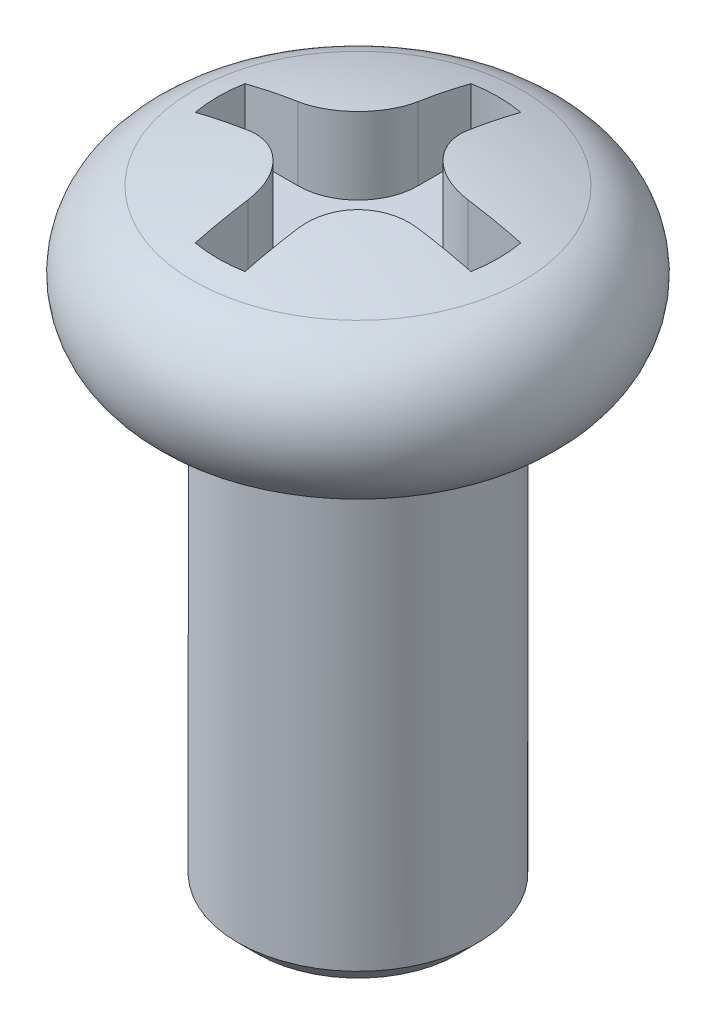
ISO-10303-21;
HEADER;
FILE_DESCRIPTION(('STEP AP214'),'2;1');
FILE_NAME('part.step','',(''),(''),'','','');
FILE_SCHEMA(('AUTOMOTIVE_DESIGN { 1 0 10303 214 1 1 1 1 }'));
ENDSEC;
DATA;
#1=APPLICATION_CONTEXT('core data for automotive mechanical design processes');
#2=APPLICATION_PROTOCOL_DEFINITION('international standard','automotive_design',2000,#1);
#3=PRODUCT_CONTEXT('',#1,'mechanical');
#4=PRODUCT('Part','Part','',(#3));
#5=PRODUCT_RELATED_PRODUCT_CATEGORY('part','',(#4));
#6=PRODUCT_DEFINITION_FORMATION('','',#4);
#7=PRODUCT_DEFINITION_CONTEXT('part definition',#1,'design');
#8=PRODUCT_DEFINITION('design','',#6,#7);
#9=PRODUCT_DEFINITION_SHAPE('','',#8);
#10=(LENGTH_UNIT() NAMED_UNIT(*) SI_UNIT(.MILLI.,.METRE.));
#11=(NAMED_UNIT(*) PLANE_ANGLE_UNIT() SI_UNIT($,.RADIAN.));
#12=(NAMED_UNIT(*) SI_UNIT($,.STERADIAN.) SOLID_ANGLE_UNIT());
#13=UNCERTAINTY_MEASURE_WITH_UNIT(LENGTH_MEASURE(1.E-05),#10,'distance_accuracy_value','');
#14=(GEOMETRIC_REPRESENTATION_CONTEXT(3) GLOBAL_UNCERTAINTY_ASSIGNED_CONTEXT((#13)) GLOBAL_UNIT_ASSIGNED_CONTEXT((#10,
#11,#12)) REPRESENTATION_CONTEXT('',''));
#15=CARTESIAN_POINT('',(0.,0.,0.));
#16=DIRECTION('',(0.,0.,1.));
#17=DIRECTION('',(1.,0.,0.));
#18=AXIS2_PLACEMENT_3D('',#15,#16,#17);
#19=CARTESIAN_POINT('',(0.,1.,0.));
#20=DIRECTION('',(0.,-1.,0.));
#21=DIRECTION('',(0.,0.,-1.));
#22=AXIS2_PLACEMENT_3D('',#19,#20,#21);
#23=PLANE('',#22);
#24=DIRECTION('',(0.,0.,1.));
#25=VECTOR('',#24,1.);
#26=CARTESIAN_POINT('',(-0.3106601717798,1.,1.722205056801));
#27=LINE('',#26,#25);
#28=CARTESIAN_POINT('',(-0.3106601717799,1.,1.06066017178));
#29=VERTEX_POINT('',#28);
#30=CARTESIAN_POINT('',(-0.3106601717798,1.,1.72220505680083));
#31=VERTEX_POINT('',#30);
#32=EDGE_CURVE('P0_E160',#29,#31,#27,.T.);
#33=ORIENTED_EDGE('',*,*,#32,.T.);
#34=CARTESIAN_POINT('',(0.,1.,0.));
#35=DIRECTION('',(0.,-1.,0.));
#36=DIRECTION('',(0.,0.,-1.));
#37=AXIS2_PLACEMENT_3D('',#34,#35,#36);
#38=CIRCLE('',#37,1.75);
#39=CARTESIAN_POINT('',(0.31066017177977,1.,1.72220505680066));
#40=VERTEX_POINT('',#39);
#41=EDGE_CURVE('P0_E232',#31,#40,#38,.F.);
#42=ORIENTED_EDGE('',*,*,#41,.T.);
#43=DIRECTION('',(0.,0.,-1.));
#44=VECTOR('',#43,1.);
#45=CARTESIAN_POINT('',(0.3106601717798,1.,1.06066017178));
#46=LINE('',#45,#44);
#47=CARTESIAN_POINT('',(0.3106601717798,1.,1.06066017178));
#48=VERTEX_POINT('',#47);
#49=EDGE_CURVE('P0_E164',#40,#48,#46,.T.);
#50=ORIENTED_EDGE('',*,*,#49,.T.);
#51=CARTESIAN_POINT('',(1.06066017178,1.,1.06066017178));
#52=DIRECTION('',(0.,-1.,0.));
#53=DIRECTION('',(0.,0.,-1.));
#54=AXIS2_PLACEMENT_3D('',#51,#52,#53);
#55=CIRCLE('',#54,0.75);
#56=CARTESIAN_POINT('',(1.06066017178,1.,0.3106601717799));
#57=VERTEX_POINT('',#56);
#58=EDGE_CURVE('P0_E167',#57,#48,#55,.F.);
#59=ORIENTED_EDGE('',*,*,#58,.F.);
#60=DIRECTION('',(1.,0.,0.));
#61=VECTOR('',#60,1.);
#62=CARTESIAN_POINT('',(1.722205056801,1.,0.3106601717798));
#63=LINE('',#62,#61);
#64=CARTESIAN_POINT('',(1.72220505680083,1.,0.3106601717798));
#65=VERTEX_POINT('',#64);
#66=EDGE_CURVE('P0_E168',#57,#65,#63,.T.);
#67=ORIENTED_EDGE('',*,*,#66,.T.);
#68=CARTESIAN_POINT('',(0.,1.,0.));
#69=DIRECTION('',(0.,-1.,0.));
#70=DIRECTION('',(0.,0.,-1.));
#71=AXIS2_PLACEMENT_3D('',#68,#69,#70);
#72=CIRCLE('',#71,1.75);
#73=CARTESIAN_POINT('',(1.72220505680066,1.,-0.31066017177977));
#74=VERTEX_POINT('',#73);
#75=EDGE_CURVE('P0_E243',#65,#74,#72,.F.);
#76=ORIENTED_EDGE('',*,*,#75,.T.);
#77=DIRECTION('',(-1.,0.,0.));
#78=VECTOR('',#77,1.);
#79=CARTESIAN_POINT('',(1.06066017178,1.,-0.3106601717798));
#80=LINE('',#79,#78);
#81=CARTESIAN_POINT('',(1.06066017178,1.,-0.3106601717798));
#82=VERTEX_POINT('',#81);
#83=EDGE_CURVE('P0_E172',#74,#82,#80,.T.);
#84=ORIENTED_EDGE('',*,*,#83,.T.);
#85=CARTESIAN_POINT('',(1.06066017178,1.,-1.06066017178));
#86=DIRECTION('',(0.,-1.,0.));
#87=DIRECTION('',(0.,0.,-1.));
#88=AXIS2_PLACEMENT_3D('',#85,#86,#87);
#89=CIRCLE('',#88,0.75);
#90=CARTESIAN_POINT('',(0.3106601717799,1.,-1.06066017178));
#91=VERTEX_POINT('',#90);
#92=EDGE_CURVE('P0_E175',#91,#82,#89,.F.);
#93=ORIENTED_EDGE('',*,*,#92,.F.);
#94=DIRECTION('',(0.,0.,-1.));
#95=VECTOR('',#94,1.);
#96=CARTESIAN_POINT('',(0.3106601717798,1.,-1.722205056801));
#97=LINE('',#96,#95);
#98=CARTESIAN_POINT('',(0.3106601717798,1.,-1.72220505680083));
#99=VERTEX_POINT('',#98);
#100=EDGE_CURVE('P0_E177',#91,#99,#97,.T.);
#101=ORIENTED_EDGE('',*,*,#100,.T.);
#102=CARTESIAN_POINT('',(0.,1.,0.));
#103=DIRECTION('',(0.,-1.,0.));
#104=DIRECTION('',(0.,0.,-1.));
#105=AXIS2_PLACEMENT_3D('',#102,#103,#104);
#106=CIRCLE('',#105,1.75);
#107=CARTESIAN_POINT('',(-0.31066017177977,1.,-1.72220505680066));
#108=VERTEX_POINT('',#107);
#109=EDGE_CURVE('P0_E136',#99,#108,#106,.F.);
#110=ORIENTED_EDGE('',*,*,#109,.T.);
#111=DIRECTION('',(0.,0.,1.));
#112=VECTOR('',#111,1.);
#113=CARTESIAN_POINT('',(-0.3106601717798,1.,-1.06066017178));
#114=LINE('',#113,#112);
#115=CARTESIAN_POINT('',(-0.3106601717798,1.,-1.06066017178));
#116=VERTEX_POINT('',#115);
#117=EDGE_CURVE('P0_E132',#108,#116,#114,.T.);
#118=ORIENTED_EDGE('',*,*,#117,.T.);
#119=CARTESIAN_POINT('',(-1.06066017178,1.,-1.06066017178));
#120=DIRECTION('',(0.,-1.,0.));
#121=DIRECTION('',(0.,0.,-1.));
#122=AXIS2_PLACEMENT_3D('',#119,#120,#121);
#123=CIRCLE('',#122,0.75);
#124=CARTESIAN_POINT('',(-1.06066017178,1.,-0.3106601717799));
#125=VERTEX_POINT('',#124);
#126=EDGE_CURVE('P0_E20',#125,#116,#123,.F.);
#127=ORIENTED_EDGE('',*,*,#126,.F.);
#128=DIRECTION('',(-1.,0.,0.));
#129=VECTOR('',#128,1.);
#130=CARTESIAN_POINT('',(-1.722205056801,1.,-0.3106601717798));
#131=LINE('',#130,#129);
#132=CARTESIAN_POINT('',(-1.72220505680066,1.,-0.31066017177977));
#133=VERTEX_POINT('',#132);
#134=EDGE_CURVE('P0_E127',#125,#133,#131,.T.);
#135=ORIENTED_EDGE('',*,*,#134,.T.);
#136=CARTESIAN_POINT('',(0.,1.,0.));
#137=DIRECTION('',(0.,-1.,0.));
#138=DIRECTION('',(0.,0.,-1.));
#139=AXIS2_PLACEMENT_3D('',#136,#137,#138);
#140=CIRCLE('',#139,1.75);
#141=CARTESIAN_POINT('',(-1.72220505680083,1.,0.3106601717798));
#142=VERTEX_POINT('',#141);
#143=EDGE_CURVE('P0_E240',#133,#142,#140,.F.);
#144=ORIENTED_EDGE('',*,*,#143,.T.);
#145=DIRECTION('',(1.,0.,0.));
#146=VECTOR('',#145,1.);
#147=CARTESIAN_POINT('',(-1.06066017178,1.,0.3106601717798));
#148=LINE('',#147,#146);
#149=CARTESIAN_POINT('',(-1.06066017178,1.,0.3106601717798));
#150=VERTEX_POINT('',#149);
#151=EDGE_CURVE('P0_E157',#142,#150,#148,.T.);
#152=ORIENTED_EDGE('',*,*,#151,.T.);
#153=CARTESIAN_POINT('',(-1.06066017178,1.,1.06066017178));
#154=DIRECTION('',(0.,-1.,0.));
#155=DIRECTION('',(0.,0.,-1.));
#156=AXIS2_PLACEMENT_3D('',#153,#154,#155);
#157=CIRCLE('',#156,0.75);
#158=EDGE_CURVE('P0_E226',#29,#150,#157,.F.);
#159=ORIENTED_EDGE('',*,*,#158,.F.);
#160=EDGE_LOOP('',(#33,#42,#50,#59,#67,#76,#84,#93,#101,#110,#118,#127,#135,#144,#152,#159));
#161=FACE_BOUND('',#160,.T.);
#162=ADVANCED_FACE('P0_F17',(#161),#23,.F.);
#163=CARTESIAN_POINT('',(-1.722205056801,1.,-0.3106601717798));
#164=DIRECTION('',(0.,0.,-1.));
#165=DIRECTION('',(-1.,0.,0.));
#166=AXIS2_PLACEMENT_3D('',#163,#164,#165);
#167=PLANE('',#166);
#168=ORIENTED_EDGE('',*,*,#134,.F.);
#169=DIRECTION('',(0.,-1.,0.));
#170=VECTOR('',#169,1.);
#171=CARTESIAN_POINT('',(-1.06066017178,1.,-0.31066017178));
#172=LINE('',#171,#170);
#173=CARTESIAN_POINT('',(-1.06066017177999,1.91090964979495,-0.310660171779999));
#174=VERTEX_POINT('',#173);
#175=EDGE_CURVE('P0_E146',#174,#125,#172,.T.);
#176=ORIENTED_EDGE('',*,*,#175,.F.);
#177=CARTESIAN_POINT('',(-1.72220505680088,1.77439135801904,-0.310660171779798));
#178=CARTESIAN_POINT('',(-1.61306309558163,1.80255002876349,-0.3106601717798));
#179=CARTESIAN_POINT('',(-1.5033633745536,1.82800588845038,-0.3106601717798));
#180=CARTESIAN_POINT('',(-1.28284841287997,1.873511985709,-0.3106601717798));
#181=CARTESIAN_POINT('',(-1.17203317223437,1.89356222328074,-0.310660171779798));
#182=CARTESIAN_POINT('',(-1.06066017177999,1.91090964979491,-0.310660171779796));
#183=B_SPLINE_CURVE_WITH_KNOTS('',3,(#177,#178,#179,#180,#181,#182),.UNSPECIFIED.,.F.,.F.,(4,2,
4),(0.,0.33784355295644,0.67568710591288),.UNSPECIFIED.);
#184=CARTESIAN_POINT('',(-1.72220505680077,1.77439135801902,-0.310660171779769));
#185=VERTEX_POINT('',#184);
#186=EDGE_CURVE('P0_E223',#185,#174,#183,.T.);
#187=ORIENTED_EDGE('',*,*,#186,.F.);
#188=DIRECTION('',(0.,-1.,0.));
#189=VECTOR('',#188,1.);
#190=CARTESIAN_POINT('',(-1.72220505680067,1.,-0.31066017177974));
#191=LINE('',#190,#189);
#192=EDGE_CURVE('P0_E238',#185,#133,#191,.T.);
#193=ORIENTED_EDGE('',*,*,#192,.T.);
#194=EDGE_LOOP('',(#168,#176,#187,#193));
#195=FACE_BOUND('',#194,.T.);
#196=ADVANCED_FACE('P0_F281',(#195),#167,.F.);
#197=CARTESIAN_POINT('',(-1.06066017178,1.,-1.06066017178));
#198=DIRECTION('',(0.,-1.,0.));
#199=DIRECTION('',(0.,0.,-1.));
#200=AXIS2_PLACEMENT_3D('',#197,#198,#199);
#201=CYLINDRICAL_SURFACE('',#200,0.75);
#202=DIRECTION('',(0.,1.,0.));
#203=VECTOR('',#202,1.);
#204=CARTESIAN_POINT('',(-0.3106601717798,1.,-1.06066017178));
#205=LINE('',#204,#203);
#206=CARTESIAN_POINT('',(-0.3106601717798,1.91090964979495,-1.06066017178));
#207=VERTEX_POINT('',#206);
#208=EDGE_CURVE('P0_E140',#116,#207,#205,.T.);
#209=ORIENTED_EDGE('',*,*,#208,.T.);
#210=CARTESIAN_POINT('',(-1.06066017177998,1.9109096497949,-0.310660171779997));
#211=CARTESIAN_POINT('',(-1.01919398648515,1.91737285226506,-0.310622939610314));
#212=CARTESIAN_POINT('',(-0.977639574393047,1.92329389693845,-0.314097480559706));
#213=CARTESIAN_POINT('',(-0.89552793577624,1.9339054188609,-0.327891873911088));
#214=CARTESIAN_POINT('',(-0.854970577087562,1.93859606001134,-0.33821081392745));
#215=CARTESIAN_POINT('',(-0.775975780143731,1.94660630127969,-0.365529421696837));
#216=CARTESIAN_POINT('',(-0.737540488476249,1.94992453437821,-0.382535717823382));
#217=CARTESIAN_POINT('',(-0.663986798206151,1.95508207214637,-0.422768684888768));
#218=CARTESIAN_POINT('',(-0.628866995291569,1.95692200546903,-0.445992706106923));
#219=CARTESIAN_POINT('',(-0.56339009730392,1.95905391047029,-0.49768518650704));
#220=CARTESIAN_POINT('',(-0.532978760843824,1.95936501960633,-0.526084168859353));
#221=CARTESIAN_POINT('',(-0.477273782501635,1.95848159980138,-0.58750191243474));
#222=CARTESIAN_POINT('',(-0.451980011342345,1.95728710889956,-0.620520556922729));
#223=CARTESIAN_POINT('',(-0.407347195185679,1.95344064774051,-0.690014136925466));
#224=CARTESIAN_POINT('',(-0.387975080904388,1.95079701072087,-0.726468333203357));
#225=CARTESIAN_POINT('',(-0.355496615735851,1.94413592237402,-0.801949736200293));
#226=CARTESIAN_POINT('',(-0.342388857988036,1.94011877985913,-0.840976362955746));
#227=CARTESIAN_POINT('',(-0.32527219723243,1.93202883522993,-0.910228995668488));
#228=CARTESIAN_POINT('',(-0.319789515730464,1.92823668158531,-0.940133694348949));
#229=CARTESIAN_POINT('',(-0.31248252687447,1.92002737932689,-1.00025806578418));
#230=CARTESIAN_POINT('',(-0.310652972676462,1.9156111368504,-1.03047722404984));
#231=CARTESIAN_POINT('',(-0.310660171779999,1.9109096497949,-1.06066017177998));
#232=B_SPLINE_CURVE_WITH_KNOTS('',3,(#210,#211,#212,#213,#214,#215,#216,#217,#218,#219,#220,
#221,#222,#223,#224,#225,#226,#227,#228,#229,#230,#231),.UNSPECIFIED.,.F.,.F.,(4,2,2,2,2,2,2,2,
2,2,4),(0.,0.125759280195427,0.25150179954673,0.377369267798946,0.503183182023199,
0.627418103733702,0.751649886696141,0.875174663537585,0.998671685908747,1.09037087197334,
1.18193825907195),.UNSPECIFIED.);
#233=EDGE_CURVE('P0_E265',#174,#207,#232,.T.);
#234=ORIENTED_EDGE('',*,*,#233,.F.);
#235=ORIENTED_EDGE('',*,*,#175,.T.);
#236=ORIENTED_EDGE('',*,*,#126,.T.);
#237=EDGE_LOOP('',(#209,#234,#235,#236));
#238=FACE_BOUND('',#237,.T.);
#239=ADVANCED_FACE('P0_F143',(#238),#201,.T.);
#240=CARTESIAN_POINT('',(-0.3106601717798,1.,-1.06066017178));
#241=DIRECTION('',(-1.,0.,0.));
#242=DIRECTION('',(0.,0.,1.));
#243=AXIS2_PLACEMENT_3D('',#240,#241,#242);
#244=PLANE('',#243);
#245=ORIENTED_EDGE('',*,*,#117,.F.);
#246=DIRECTION('',(0.,-1.,0.));
#247=VECTOR('',#246,1.);
#248=CARTESIAN_POINT('',(-0.310660171779741,1.,-1.72220505680067));
#249=LINE('',#248,#247);
#250=CARTESIAN_POINT('',(-0.3106601717798,1.77439135801905,-1.72220505680075));
#251=VERTEX_POINT('',#250);
#252=EDGE_CURVE('P0_E152',#108,#251,#249,.F.);
#253=ORIENTED_EDGE('',*,*,#252,.T.);
#254=CARTESIAN_POINT('',(-0.3106601717798,-4.9,0.));
#255=DIRECTION('',(-1.,0.,0.));
#256=DIRECTION('',(0.,0.,1.));
#257=AXIS2_PLACEMENT_3D('',#254,#255,#256);
#258=CIRCLE('',#257,6.89300299272166);
#259=EDGE_CURVE('P0_E149',#207,#251,#258,.T.);
#260=ORIENTED_EDGE('',*,*,#259,.F.);
#261=ORIENTED_EDGE('',*,*,#208,.F.);
#262=EDGE_LOOP('',(#245,#253,#260,#261));
#263=FACE_BOUND('',#262,.T.);
#264=ADVANCED_FACE('P0_F147',(#263),#244,.F.);
#265=CARTESIAN_POINT('',(0.,1.,0.));
#266=DIRECTION('',(0.,-1.,0.));
#267=DIRECTION('',(0.,0.,-1.));
#268=AXIS2_PLACEMENT_3D('',#265,#266,#267);
#269=CYLINDRICAL_SURFACE('',#268,1.75);
#270=ORIENTED_EDGE('',*,*,#109,.F.);
#271=DIRECTION('',(0.,1.,0.));
#272=VECTOR('',#271,1.);
#273=CARTESIAN_POINT('',(0.3106601717798,1.,-1.722205056801));
#274=LINE('',#273,#272);
#275=CARTESIAN_POINT('',(0.310660171779799,1.774391358019,-1.72220505680092));
#276=VERTEX_POINT('',#275);
#277=EDGE_CURVE('P0_E178',#99,#276,#274,.T.);
#278=ORIENTED_EDGE('',*,*,#277,.T.);
#279=CARTESIAN_POINT('',(0.,1.774391358019,0.));
#280=DIRECTION('',(0.,-1.,0.));
#281=DIRECTION('',(0.,0.,-1.));
#282=AXIS2_PLACEMENT_3D('',#279,#280,#281);
#283=CIRCLE('',#282,1.75);
#284=EDGE_CURVE('P0_E253',#251,#276,#283,.T.);
#285=ORIENTED_EDGE('',*,*,#284,.F.);
#286=ORIENTED_EDGE('',*,*,#252,.F.);
#287=EDGE_LOOP('',(#270,#278,#285,#286));
#288=FACE_BOUND('',#287,.T.);
#289=ADVANCED_FACE('P0_F251',(#288),#269,.F.);
#290=CARTESIAN_POINT('',(0.3106601717798,1.,-1.722205056801));
#291=DIRECTION('',(1.,0.,0.));
#292=DIRECTION('',(0.,0.,-1.));
#293=AXIS2_PLACEMENT_3D('',#290,#291,#292);
#294=PLANE('',#293);
#295=ORIENTED_EDGE('',*,*,#100,.F.);
#296=DIRECTION('',(0.,-1.,0.));
#297=VECTOR('',#296,1.);
#298=CARTESIAN_POINT('',(0.31066017178,1.,-1.06066017178));
#299=LINE('',#298,#297);
#300=CARTESIAN_POINT('',(0.310660171779899,1.91090964979495,-1.06066017178));
#301=VERTEX_POINT('',#300);
#302=EDGE_CURVE('P0_E245',#301,#91,#299,.T.);
#303=ORIENTED_EDGE('',*,*,#302,.F.);
#304=CARTESIAN_POINT('',(0.310660171779799,-4.9,0.));
#305=DIRECTION('',(-1.,0.,0.));
#306=DIRECTION('',(0.,0.,1.));
#307=AXIS2_PLACEMENT_3D('',#304,#305,#306);
#308=CIRCLE('',#307,6.89300299272166);
#309=EDGE_CURVE('P0_E256',#276,#301,#308,.F.);
#310=ORIENTED_EDGE('',*,*,#309,.F.);
#311=ORIENTED_EDGE('',*,*,#277,.F.);
#312=EDGE_LOOP('',(#295,#303,#310,#311));
#313=FACE_BOUND('',#312,.T.);
#314=ADVANCED_FACE('P0_F257',(#313),#294,.F.);
#315=CARTESIAN_POINT('',(1.06066017178,1.,-1.06066017178));
#316=DIRECTION('',(0.,-1.,0.));
#317=DIRECTION('',(0.,0.,-1.));
#318=AXIS2_PLACEMENT_3D('',#315,#316,#317);
#319=CYLINDRICAL_SURFACE('',#318,0.75);
#320=DIRECTION('',(0.,1.,0.));
#321=VECTOR('',#320,1.);
#322=CARTESIAN_POINT('',(1.06066017178,1.,-0.3106601717798));
#323=LINE('',#322,#321);
#324=CARTESIAN_POINT('',(1.06066017177999,1.91090964979495,-0.310660171779798));
#325=VERTEX_POINT('',#324);
#326=EDGE_CURVE('P0_E174',#82,#325,#323,.T.);
#327=ORIENTED_EDGE('',*,*,#326,.T.);
#328=CARTESIAN_POINT('',(0.31066017178,1.9109096497949,-1.06066017177998));
#329=CARTESIAN_POINT('',(0.310622939610315,1.91737285226506,-1.01919398648515));
#330=CARTESIAN_POINT('',(0.314097480559706,1.92329389693845,-0.977639574393049));
#331=CARTESIAN_POINT('',(0.327891873911087,1.9339054188609,-0.895527935776246));
#332=CARTESIAN_POINT('',(0.338210813927448,1.93859606001134,-0.85497057708757));
#333=CARTESIAN_POINT('',(0.365529421696833,1.94660630127969,-0.775975780143742));
#334=CARTESIAN_POINT('',(0.382535717823376,1.9499245343782,-0.737540488476261));
#335=CARTESIAN_POINT('',(0.422768684888759,1.95508207214636,-0.663986798206166));
#336=CARTESIAN_POINT('',(0.445992706106912,1.95692200546903,-0.628866995291585));
#337=CARTESIAN_POINT('',(0.497685186507026,1.95905391047029,-0.563390097303936));
#338=CARTESIAN_POINT('',(0.526084168859338,1.95936501960633,-0.53297876084384));
#339=CARTESIAN_POINT('',(0.587501912434723,1.95848159980138,-0.477273782501648));
#340=CARTESIAN_POINT('',(0.620520556922711,1.95728710889957,-0.451980011342356));
#341=CARTESIAN_POINT('',(0.690014136925447,1.95344064774051,-0.407347195185688));
#342=CARTESIAN_POINT('',(0.726468333203338,1.95079701072088,-0.387975080904397));
#343=CARTESIAN_POINT('',(0.801949736200273,1.94413592237402,-0.35549661573586));
#344=CARTESIAN_POINT('',(0.840976362955726,1.94011877985913,-0.342388857988044));
#345=CARTESIAN_POINT('',(0.91022899566847,1.93202883522993,-0.325272197232435));
#346=CARTESIAN_POINT('',(0.940133694348936,1.92823668158531,-0.319789515730467));
#347=CARTESIAN_POINT('',(1.00025806578417,1.92002737932689,-0.312482526874469));
#348=CARTESIAN_POINT('',(1.03047722404984,1.9156111368504,-0.310652972676461));
#349=CARTESIAN_POINT('',(1.06066017177998,1.9109096497949,-0.310660171779998));
#350=B_SPLINE_CURVE_WITH_KNOTS('',3,(#328,#329,#330,#331,#332,#333,#334,#335,#336,#337,#338,
#339,#340,#341,#342,#343,#344,#345,#346,#347,#348,#349),.UNSPECIFIED.,.F.,.F.,(4,2,2,2,2,2,2,2,
2,2,4),(0.,0.125759280195421,0.251501799546719,0.377369267798928,0.503183182023175,
0.627418103733679,0.751649886696118,0.875174663537562,0.998671685908723,1.09037087197333,
1.18193825907195),.UNSPECIFIED.);
#351=EDGE_CURVE('P0_E261',#301,#325,#350,.T.);
#352=ORIENTED_EDGE('',*,*,#351,.F.);
#353=ORIENTED_EDGE('',*,*,#302,.T.);
#354=ORIENTED_EDGE('',*,*,#92,.T.);
#355=EDGE_LOOP('',(#327,#352,#353,#354));
#356=FACE_BOUND('',#355,.T.);
#357=ADVANCED_FACE('P0_F400',(#356),#319,.T.);
#358=CARTESIAN_POINT('',(1.06066017178,1.,-0.3106601717798));
#359=DIRECTION('',(0.,0.,-1.));
#360=DIRECTION('',(-1.,0.,0.));
#361=AXIS2_PLACEMENT_3D('',#358,#359,#360);
#362=PLANE('',#361);
#363=ORIENTED_EDGE('',*,*,#83,.F.);
#364=DIRECTION('',(0.,-1.,0.));
#365=VECTOR('',#364,1.);
#366=CARTESIAN_POINT('',(1.72220505680067,1.,-0.31066017177974));
#367=LINE('',#366,#365);
#368=CARTESIAN_POINT('',(1.72220505680066,1.774391358019,-0.31066017177977));
#369=VERTEX_POINT('',#368);
#370=EDGE_CURVE('P0_E171',#74,#369,#367,.F.);
#371=ORIENTED_EDGE('',*,*,#370,.T.);
#372=CARTESIAN_POINT('',(1.06066017177999,1.91090964979491,-0.310660171779797));
#373=CARTESIAN_POINT('',(1.17203317223437,1.89356222328074,-0.310660171779799));
#374=CARTESIAN_POINT('',(1.28284841287997,1.873511985709,-0.3106601717798));
#375=CARTESIAN_POINT('',(1.5033633745536,1.82800588845038,-0.3106601717798));
#376=CARTESIAN_POINT('',(1.61306309558163,1.80255002876349,-0.310660171779799));
#377=CARTESIAN_POINT('',(1.72220505680088,1.77439135801904,-0.310660171779797));
#378=B_SPLINE_CURVE_WITH_KNOTS('',3,(#372,#373,#374,#375,#376,#377),.UNSPECIFIED.,.F.,.F.,(4,2,
4),(0.,0.33784355295644,0.675687105912881),.UNSPECIFIED.);
#379=EDGE_CURVE('P0_E506',#325,#369,#378,.T.);
#380=ORIENTED_EDGE('',*,*,#379,.F.);
#381=ORIENTED_EDGE('',*,*,#326,.F.);
#382=EDGE_LOOP('',(#363,#371,#380,#381));
#383=FACE_BOUND('',#382,.T.);
#384=ADVANCED_FACE('P0_F392',(#383),#362,.F.);
#385=CARTESIAN_POINT('',(0.,1.,0.));
#386=DIRECTION('',(0.,-1.,0.));
#387=DIRECTION('',(0.,0.,-1.));
#388=AXIS2_PLACEMENT_3D('',#385,#386,#387);
#389=CYLINDRICAL_SURFACE('',#388,1.75);
#390=ORIENTED_EDGE('',*,*,#143,.F.);
#391=ORIENTED_EDGE('',*,*,#192,.F.);
#392=CARTESIAN_POINT('',(0.,1.774391358019,0.));
#393=DIRECTION('',(0.,-1.,0.));
#394=DIRECTION('',(0.,0.,-1.));
#395=AXIS2_PLACEMENT_3D('',#392,#393,#394);
#396=CIRCLE('',#395,1.75);
#397=CARTESIAN_POINT('',(-1.72220505680083,1.774391358019,0.3106601717798));
#398=VERTEX_POINT('',#397);
#399=EDGE_CURVE('P0_E512',#398,#185,#396,.T.);
#400=ORIENTED_EDGE('',*,*,#399,.F.);
#401=DIRECTION('',(0.,1.,0.));
#402=VECTOR('',#401,1.);
#403=CARTESIAN_POINT('',(-1.722205056801,1.,0.3106601717798));
#404=LINE('',#403,#402);
#405=EDGE_CURVE('P0_E159',#398,#142,#404,.F.);
#406=ORIENTED_EDGE('',*,*,#405,.T.);
#407=EDGE_LOOP('',(#390,#391,#400,#406));
#408=FACE_BOUND('',#407,.T.);
#409=ADVANCED_FACE('P0_F384',(#408),#389,.F.);
#410=CARTESIAN_POINT('',(0.,1.,0.));
#411=DIRECTION('',(0.,-1.,0.));
#412=DIRECTION('',(0.,0.,-1.));
#413=AXIS2_PLACEMENT_3D('',#410,#411,#412);
#414=CYLINDRICAL_SURFACE('',#413,1.75);
#415=ORIENTED_EDGE('',*,*,#370,.F.);
#416=ORIENTED_EDGE('',*,*,#75,.F.);
#417=DIRECTION('',(0.,1.,0.));
#418=VECTOR('',#417,1.);
#419=CARTESIAN_POINT('',(1.722205056801,1.,0.3106601717798));
#420=LINE('',#419,#418);
#421=CARTESIAN_POINT('',(1.72220505680097,1.77439135801901,0.3106601717798));
#422=VERTEX_POINT('',#421);
#423=EDGE_CURVE('P0_E170',#65,#422,#420,.T.);
#424=ORIENTED_EDGE('',*,*,#423,.T.);
#425=CARTESIAN_POINT('',(0.,1.774391358019,0.));
#426=DIRECTION('',(0.,-1.,0.));
#427=DIRECTION('',(0.,0.,-1.));
#428=AXIS2_PLACEMENT_3D('',#425,#426,#427);
#429=CIRCLE('',#428,1.75);
#430=EDGE_CURVE('P0_E514',#369,#422,#429,.T.);
#431=ORIENTED_EDGE('',*,*,#430,.F.);
#432=EDGE_LOOP('',(#415,#416,#424,#431));
#433=FACE_BOUND('',#432,.T.);
#434=ADVANCED_FACE('P0_F376',(#433),#414,.F.);
#435=CARTESIAN_POINT('',(1.722205056801,1.,0.3106601717798));
#436=DIRECTION('',(0.,0.,1.));
#437=DIRECTION('',(1.,0.,0.));
#438=AXIS2_PLACEMENT_3D('',#435,#436,#437);
#439=PLANE('',#438);
#440=ORIENTED_EDGE('',*,*,#66,.F.);
#441=DIRECTION('',(0.,-1.,0.));
#442=VECTOR('',#441,1.);
#443=CARTESIAN_POINT('',(1.06066017178,1.,0.31066017178));
#444=LINE('',#443,#442);
#445=CARTESIAN_POINT('',(1.06066017177999,1.91090964979495,0.310660171780001));
#446=VERTEX_POINT('',#445);
#447=EDGE_CURVE('P0_E234',#446,#57,#444,.T.);
#448=ORIENTED_EDGE('',*,*,#447,.F.);
#449=CARTESIAN_POINT('',(1.72220505680094,1.77439135801902,0.310660171779801));
#450=CARTESIAN_POINT('',(1.61306309558168,1.80255002876348,0.3106601717798));
#451=CARTESIAN_POINT('',(1.50336337455365,1.82800588845037,0.3106601717798));
#452=CARTESIAN_POINT('',(1.28284841288,1.873511985709,0.3106601717798));
#453=CARTESIAN_POINT('',(1.17203317223438,1.89356222328074,0.310660171779801));
#454=CARTESIAN_POINT('',(1.06066017177999,1.91090964979491,0.310660171779802));
#455=B_SPLINE_CURVE_WITH_KNOTS('',3,(#449,#450,#451,#452,#453,#454),.UNSPECIFIED.,.F.,.F.,(4,2,
4),(0.,0.337843552956472,0.675687105912945),.UNSPECIFIED.);
#456=EDGE_CURVE('P0_E516',#422,#446,#455,.T.);
#457=ORIENTED_EDGE('',*,*,#456,.F.);
#458=ORIENTED_EDGE('',*,*,#423,.F.);
#459=EDGE_LOOP('',(#440,#448,#457,#458));
#460=FACE_BOUND('',#459,.T.);
#461=ADVANCED_FACE('P0_F368',(#460),#439,.F.);
#462=CARTESIAN_POINT('',(1.06066017178,1.,1.06066017178));
#463=DIRECTION('',(0.,-1.,0.));
#464=DIRECTION('',(0.,0.,-1.));
#465=AXIS2_PLACEMENT_3D('',#462,#463,#464);
#466=CYLINDRICAL_SURFACE('',#465,0.75);
#467=DIRECTION('',(0.,1.,0.));
#468=VECTOR('',#467,1.);
#469=CARTESIAN_POINT('',(0.3106601717798,1.,1.06066017178));
#470=LINE('',#469,#468);
#471=CARTESIAN_POINT('',(0.310660171779799,1.91090964979495,1.06066017178));
#472=VERTEX_POINT('',#471);
#473=EDGE_CURVE('P0_E166',#48,#472,#470,.T.);
#474=ORIENTED_EDGE('',*,*,#473,.T.);
#475=CARTESIAN_POINT('',(1.06066017177998,1.9109096497949,0.310660171780001));
#476=CARTESIAN_POINT('',(1.01919398648515,1.91737285226506,0.310622939610313));
#477=CARTESIAN_POINT('',(0.977639574393047,1.92329389693845,0.314097480559705));
#478=CARTESIAN_POINT('',(0.89552793577624,1.9339054188609,0.327891873911089));
#479=CARTESIAN_POINT('',(0.854970577087563,1.93859606001134,0.338210813927453));
#480=CARTESIAN_POINT('',(0.775975780143732,1.94660630127969,0.365529421696841));
#481=CARTESIAN_POINT('',(0.737540488476249,1.94992453437821,0.382535717823383));
#482=CARTESIAN_POINT('',(0.66398679820615,1.95508207214636,0.422768684888768));
#483=CARTESIAN_POINT('',(0.628866995291568,1.95692200546903,0.445992706106925));
#484=CARTESIAN_POINT('',(0.56339009730392,1.95905391047029,0.497685186507042));
#485=CARTESIAN_POINT('',(0.532978760843824,1.95936501960633,0.526084168859354));
#486=CARTESIAN_POINT('',(0.477273782501635,1.95848159980138,0.587501912434738));
#487=CARTESIAN_POINT('',(0.451980011342344,1.95728710889956,0.620520556922726));
#488=CARTESIAN_POINT('',(0.407347195185677,1.95344064774051,0.690014136925462));
#489=CARTESIAN_POINT('',(0.387975080904388,1.95079701072088,0.726468333203355));
#490=CARTESIAN_POINT('',(0.355496615735852,1.94413592237402,0.801949736200294));
#491=CARTESIAN_POINT('',(0.342388857988037,1.94011877985913,0.840976362955748));
#492=CARTESIAN_POINT('',(0.32527219723243,1.93202883522993,0.91022899566849));
#493=CARTESIAN_POINT('',(0.319789515730464,1.92823668158531,0.940133694348952));
#494=CARTESIAN_POINT('',(0.312482526874469,1.92002737932689,1.00025806578418));
#495=CARTESIAN_POINT('',(0.310652972676462,1.9156111368504,1.03047722404985));
#496=CARTESIAN_POINT('',(0.31066017178,1.9109096497949,1.06066017177999));
#497=B_SPLINE_CURVE_WITH_KNOTS('',3,(#475,#476,#477,#478,#479,#480,#481,#482,#483,#484,#485,
#486,#487,#488,#489,#490,#491,#492,#493,#494,#495,#496),.UNSPECIFIED.,.F.,.F.,(4,2,2,2,2,2,2,2,
2,2,4),(0.,0.125759280195427,0.251501799546731,0.377369267798946,0.5031831820232,
0.627418103733702,0.751649886696138,0.875174663537584,0.998671685908749,1.09037087197335,
1.18193825907195),.UNSPECIFIED.);
#498=EDGE_CURVE('P0_E522',#446,#472,#497,.T.);
#499=ORIENTED_EDGE('',*,*,#498,.F.);
#500=ORIENTED_EDGE('',*,*,#447,.T.);
#501=ORIENTED_EDGE('',*,*,#58,.T.);
#502=EDGE_LOOP('',(#474,#499,#500,#501));
#503=FACE_BOUND('',#502,.T.);
#504=ADVANCED_FACE('P0_F360',(#503),#466,.T.);
#505=CARTESIAN_POINT('',(0.3106601717798,1.,1.06066017178));
#506=DIRECTION('',(1.,0.,0.));
#507=DIRECTION('',(0.,0.,-1.));
#508=AXIS2_PLACEMENT_3D('',#505,#506,#507);
#509=PLANE('',#508);
#510=ORIENTED_EDGE('',*,*,#49,.F.);
#511=DIRECTION('',(0.,-1.,0.));
#512=VECTOR('',#511,1.);
#513=CARTESIAN_POINT('',(0.31066017177974,1.,1.72220505680067));
#514=LINE('',#513,#512);
#515=CARTESIAN_POINT('',(0.310660171779799,1.77439135801905,1.72220505680075));
#516=VERTEX_POINT('',#515);
#517=EDGE_CURVE('P0_E163',#40,#516,#514,.F.);
#518=ORIENTED_EDGE('',*,*,#517,.T.);
#519=CARTESIAN_POINT('',(0.310660171779799,-4.9,0.));
#520=DIRECTION('',(-1.,0.,0.));
#521=DIRECTION('',(0.,0.,1.));
#522=AXIS2_PLACEMENT_3D('',#519,#520,#521);
#523=CIRCLE('',#522,6.89300299272166);
#524=EDGE_CURVE('P0_E531',#472,#516,#523,.F.);
#525=ORIENTED_EDGE('',*,*,#524,.F.);
#526=ORIENTED_EDGE('',*,*,#473,.F.);
#527=EDGE_LOOP('',(#510,#518,#525,#526));
#528=FACE_BOUND('',#527,.T.);
#529=ADVANCED_FACE('P0_F352',(#528),#509,.F.);
#530=CARTESIAN_POINT('',(0.,1.,0.));
#531=DIRECTION('',(0.,-1.,0.));
#532=DIRECTION('',(0.,0.,-1.));
#533=AXIS2_PLACEMENT_3D('',#530,#531,#532);
#534=CYLINDRICAL_SURFACE('',#533,1.75);
#535=ORIENTED_EDGE('',*,*,#41,.F.);
#536=DIRECTION('',(0.,1.,0.));
#537=VECTOR('',#536,1.);
#538=CARTESIAN_POINT('',(-0.3106601717798,1.,1.722205056801));
#539=LINE('',#538,#537);
#540=CARTESIAN_POINT('',(-0.3106601717798,1.774391358019,1.72220505680092));
#541=VERTEX_POINT('',#540);
#542=EDGE_CURVE('P0_E162',#31,#541,#539,.T.);
#543=ORIENTED_EDGE('',*,*,#542,.T.);
#544=CARTESIAN_POINT('',(0.,1.774391358019,0.));
#545=DIRECTION('',(0.,-1.,0.));
#546=DIRECTION('',(0.,0.,-1.));
#547=AXIS2_PLACEMENT_3D('',#544,#545,#546);
#548=CIRCLE('',#547,1.75);
#549=EDGE_CURVE('P0_E534',#516,#541,#548,.T.);
#550=ORIENTED_EDGE('',*,*,#549,.F.);
#551=ORIENTED_EDGE('',*,*,#517,.F.);
#552=EDGE_LOOP('',(#535,#543,#550,#551));
#553=FACE_BOUND('',#552,.T.);
#554=ADVANCED_FACE('P0_F344',(#553),#534,.F.);
#555=CARTESIAN_POINT('',(-0.3106601717798,1.,1.722205056801));
#556=DIRECTION('',(-1.,0.,0.));
#557=DIRECTION('',(0.,0.,1.));
#558=AXIS2_PLACEMENT_3D('',#555,#556,#557);
#559=PLANE('',#558);
#560=ORIENTED_EDGE('',*,*,#32,.F.);
#561=DIRECTION('',(0.,-1.,0.));
#562=VECTOR('',#561,1.);
#563=CARTESIAN_POINT('',(-0.31066017178,1.,1.06066017178));
#564=LINE('',#563,#562);
#565=CARTESIAN_POINT('',(-0.3106601717799,1.91090964979495,1.06066017178));
#566=VERTEX_POINT('',#565);
#567=EDGE_CURVE('P0_E227',#566,#29,#564,.T.);
#568=ORIENTED_EDGE('',*,*,#567,.F.);
#569=CARTESIAN_POINT('',(-0.3106601717798,-4.9,0.));
#570=DIRECTION('',(-1.,0.,0.));
#571=DIRECTION('',(0.,0.,1.));
#572=AXIS2_PLACEMENT_3D('',#569,#570,#571);
#573=CIRCLE('',#572,6.89300299272166);
#574=EDGE_CURVE('P0_E536',#541,#566,#573,.T.);
#575=ORIENTED_EDGE('',*,*,#574,.F.);
#576=ORIENTED_EDGE('',*,*,#542,.F.);
#577=EDGE_LOOP('',(#560,#568,#575,#576));
#578=FACE_BOUND('',#577,.T.);
#579=ADVANCED_FACE('P0_F338',(#578),#559,.F.);
#580=CARTESIAN_POINT('',(-1.06066017178,1.,1.06066017178));
#581=DIRECTION('',(0.,-1.,0.));
#582=DIRECTION('',(0.,0.,-1.));
#583=AXIS2_PLACEMENT_3D('',#580,#581,#582);
#584=CYLINDRICAL_SURFACE('',#583,0.75);
#585=DIRECTION('',(0.,1.,0.));
#586=VECTOR('',#585,1.);
#587=CARTESIAN_POINT('',(-1.06066017178,1.,0.3106601717798));
#588=LINE('',#587,#586);
#589=CARTESIAN_POINT('',(-1.06066017177999,1.91090964979495,0.310660171779801));
#590=VERTEX_POINT('',#589);
#591=EDGE_CURVE('P0_E35',#150,#590,#588,.T.);
#592=ORIENTED_EDGE('',*,*,#591,.T.);
#593=CARTESIAN_POINT('',(-0.310660171779999,1.9109096497949,1.06066017177999));
#594=CARTESIAN_POINT('',(-0.310622939610314,1.91737285226506,1.01919398648515));
#595=CARTESIAN_POINT('',(-0.314097480559706,1.92329389693845,0.977639574393052));
#596=CARTESIAN_POINT('',(-0.327891873911086,1.9339054188609,0.895527935776248));
#597=CARTESIAN_POINT('',(-0.338210813927447,1.93859606001134,0.854970577087572));
#598=CARTESIAN_POINT('',(-0.365529421696833,1.94660630127969,0.775975780143745));
#599=CARTESIAN_POINT('',(-0.382535717823375,1.9499245343782,0.737540488476264));
#600=CARTESIAN_POINT('',(-0.422768684888758,1.95508207214636,0.663986798206168));
#601=CARTESIAN_POINT('',(-0.445992706106911,1.95692200546903,0.628866995291587));
#602=CARTESIAN_POINT('',(-0.497685186507025,1.95905391047029,0.563390097303938));
#603=CARTESIAN_POINT('',(-0.526084168859337,1.95936501960633,0.532978760843841));
#604=CARTESIAN_POINT('',(-0.587501912434721,1.95848159980138,0.47727378250165));
#605=CARTESIAN_POINT('',(-0.620520556922709,1.95728710889957,0.451980011342359));
#606=CARTESIAN_POINT('',(-0.690014136925444,1.95344064774051,0.40734719518569));
#607=CARTESIAN_POINT('',(-0.726468333203335,1.95079701072088,0.387975080904398));
#608=CARTESIAN_POINT('',(-0.80194973620027,1.94413592237402,0.355496615735861));
#609=CARTESIAN_POINT('',(-0.840976362955724,1.94011877985913,0.342388857988047));
#610=CARTESIAN_POINT('',(-0.910228995668468,1.93202883522993,0.325272197232437));
#611=CARTESIAN_POINT('',(-0.940133694348933,1.92823668158531,0.319789515730468));
#612=CARTESIAN_POINT('',(-1.00025806578417,1.92002737932689,0.312482526874469));
#613=CARTESIAN_POINT('',(-1.03047722404984,1.9156111368504,0.31065297267646));
#614=CARTESIAN_POINT('',(-1.06066017177998,1.9109096497949,0.310660171780001));
#615=B_SPLINE_CURVE_WITH_KNOTS('',3,(#593,#594,#595,#596,#597,#598,#599,#600,#601,#602,#603,
#604,#605,#606,#607,#608,#609,#610,#611,#612,#613,#614),.UNSPECIFIED.,.F.,.F.,(4,2,2,2,2,2,2,2,
2,2,4),(0.,0.125759280195422,0.25150179954672,0.377369267798929,0.503183182023177,
0.62741810373368,0.751649886696119,0.875174663537562,0.998671685908724,1.09037087197333,
1.18193825907195),.UNSPECIFIED.);
#616=EDGE_CURVE('P0_E199',#566,#590,#615,.T.);
#617=ORIENTED_EDGE('',*,*,#616,.F.);
#618=ORIENTED_EDGE('',*,*,#567,.T.);
#619=ORIENTED_EDGE('',*,*,#158,.T.);
#620=EDGE_LOOP('',(#592,#617,#618,#619));
#621=FACE_BOUND('',#620,.T.);
#622=ADVANCED_FACE('P0_F331',(#621),#584,.T.);
#623=CARTESIAN_POINT('',(-1.06066017178,1.,0.3106601717798));
#624=DIRECTION('',(0.,0.,1.));
#625=DIRECTION('',(1.,0.,0.));
#626=AXIS2_PLACEMENT_3D('',#623,#624,#625);
#627=PLANE('',#626);
#628=ORIENTED_EDGE('',*,*,#151,.F.);
#629=ORIENTED_EDGE('',*,*,#405,.F.);
#630=CARTESIAN_POINT('',(-1.06066017177999,1.91090964979491,0.310660171779802));
#631=CARTESIAN_POINT('',(-1.17203317223438,1.89356222328074,0.310660171779801));
#632=CARTESIAN_POINT('',(-1.28284841287999,1.873511985709,0.3106601717798));
#633=CARTESIAN_POINT('',(-1.50336337455365,1.82800588845037,0.3106601717798));
#634=CARTESIAN_POINT('',(-1.61306309558169,1.80255002876348,0.3106601717798));
#635=CARTESIAN_POINT('',(-1.72220505680094,1.77439135801902,0.310660171779801));
#636=B_SPLINE_CURVE_WITH_KNOTS('',3,(#630,#631,#632,#633,#634,#635),.UNSPECIFIED.,.F.,.F.,(4,2,
4),(0.,0.337843552956473,0.675687105912946),.UNSPECIFIED.);
#637=EDGE_CURVE('P0_E191',#590,#398,#636,.T.);
#638=ORIENTED_EDGE('',*,*,#637,.F.);
#639=ORIENTED_EDGE('',*,*,#591,.F.);
#640=EDGE_LOOP('',(#628,#629,#638,#639));
#641=FACE_BOUND('',#640,.T.);
#642=ADVANCED_FACE('P0_F205',(#641),#627,.F.);
#643=CARTESIAN_POINT('',(0.,-4.9,0.));
#644=DIRECTION('',(-1.,0.,0.));
#645=DIRECTION('',(0.,0.,-1.));
#646=AXIS2_PLACEMENT_3D('',#643,#644,#645);
#647=SPHERICAL_SURFACE('',#646,6.9);
#648=CARTESIAN_POINT('',(0.,1.68583813108793,0.));
#649=DIRECTION('',(0.,-1.,0.));
#650=DIRECTION('',(-1.,0.,0.));
#651=AXIS2_PLACEMENT_3D('',#648,#649,#650);
#652=CIRCLE('',#651,2.05833333333298);
#653=CARTESIAN_POINT('',(-2.05833333333298,1.68583813108793,0.));
#654=VERTEX_POINT('',#653);
#655=EDGE_CURVE('P0_E188',#654,#654,#652,.T.);
#656=ORIENTED_EDGE('',*,*,#655,.F.);
#657=EDGE_LOOP('',(#656));
#658=FACE_BOUND('',#657,.T.);
#659=ORIENTED_EDGE('',*,*,#616,.T.);
#660=ORIENTED_EDGE('',*,*,#637,.T.);
#661=ORIENTED_EDGE('',*,*,#399,.T.);
#662=ORIENTED_EDGE('',*,*,#186,.T.);
#663=ORIENTED_EDGE('',*,*,#233,.T.);
#664=ORIENTED_EDGE('',*,*,#259,.T.);
#665=ORIENTED_EDGE('',*,*,#284,.T.);
#666=ORIENTED_EDGE('',*,*,#309,.T.);
#667=ORIENTED_EDGE('',*,*,#351,.T.);
#668=ORIENTED_EDGE('',*,*,#379,.T.);
#669=ORIENTED_EDGE('',*,*,#430,.T.);
#670=ORIENTED_EDGE('',*,*,#456,.T.);
#671=ORIENTED_EDGE('',*,*,#498,.T.);
#672=ORIENTED_EDGE('',*,*,#524,.T.);
#673=ORIENTED_EDGE('',*,*,#549,.T.);
#674=ORIENTED_EDGE('',*,*,#574,.T.);
#675=EDGE_LOOP('',(#659,#660,#661,#662,#663,#664,#665,#666,#667,#668,#669,#670,#671,#672,#673,#674));
#676=FACE_BOUND('',#675,.T.);
#677=ADVANCED_FACE('P0_F207',(#658,#676),#647,.T.);
#678=CARTESIAN_POINT('',(0.,0.7450041123609,0.));
#679=DIRECTION('',(0.,-1.,0.));
#680=DIRECTION('',(-1.,0.,0.));
#681=AXIS2_PLACEMENT_3D('',#678,#679,#680);
#682=TOROIDAL_SURFACE('',#681,1.764285714286,0.9857142857143);
#683=CARTESIAN_POINT('',(0.,0.,0.));
#684=DIRECTION('',(0.,-1.,0.));
#685=DIRECTION('',(0.,0.,-1.));
#686=AXIS2_PLACEMENT_3D('',#683,#684,#685);
#687=CIRCLE('',#686,2.40973247864895);
#688=CARTESIAN_POINT('',(0.,0.,-2.40973247864895));
#689=VERTEX_POINT('',#688);
#690=EDGE_CURVE('P0_E185',#689,#689,#687,.T.);
#691=ORIENTED_EDGE('',*,*,#690,.F.);
#692=EDGE_LOOP('',(#691));
#693=FACE_BOUND('',#692,.T.);
#694=ORIENTED_EDGE('',*,*,#655,.T.);
#695=EDGE_LOOP('',(#694));
#696=FACE_BOUND('',#695,.T.);
#697=ADVANCED_FACE('P0_F212',(#693,#696),#682,.T.);
#698=CARTESIAN_POINT('',(0.,-6.,0.));
#699=DIRECTION('',(0.,-1.,0.));
#700=DIRECTION('',(0.,0.,-1.));
#701=AXIS2_PLACEMENT_3D('',#698,#699,#700);
#702=PLANE('',#701);
#703=CARTESIAN_POINT('',(0.,-5.99999999997181,0.));
#704=DIRECTION('',(0.,1.,0.));
#705=DIRECTION('',(0.,0.,1.));
#706=AXIS2_PLACEMENT_3D('',#703,#704,#705);
#707=CIRCLE('',#706,1.25000000002728);
#708=CARTESIAN_POINT('',(0.,-5.99999999997181,1.25000000002728));
#709=VERTEX_POINT('',#708);
#710=EDGE_CURVE('P0_E182',#709,#709,#707,.T.);
#711=ORIENTED_EDGE('',*,*,#710,.F.);
#712=EDGE_LOOP('',(#711));
#713=FACE_BOUND('',#712,.T.);
#714=ADVANCED_FACE('P0_F303',(#713),#702,.T.);
#715=CARTESIAN_POINT('',(0.,0.,0.));
#716=DIRECTION('',(0.,-1.,0.));
#717=DIRECTION('',(0.,0.,-1.));
#718=AXIS2_PLACEMENT_3D('',#715,#716,#717);
#719=PLANE('',#718);
#720=CARTESIAN_POINT('',(0.,0.,0.));
#721=DIRECTION('',(0.,-1.,0.));
#722=DIRECTION('',(0.,0.,-1.));
#723=AXIS2_PLACEMENT_3D('',#720,#721,#722);
#724=CIRCLE('',#723,1.5);
#725=CARTESIAN_POINT('',(0.,0.,-1.5));
#726=VERTEX_POINT('',#725);
#727=EDGE_CURVE('P0_E26',#726,#726,#724,.T.);
#728=ORIENTED_EDGE('',*,*,#727,.F.);
#729=EDGE_LOOP('',(#728));
#730=FACE_BOUND('',#729,.T.);
#731=ORIENTED_EDGE('',*,*,#690,.T.);
#732=EDGE_LOOP('',(#731));
#733=FACE_BOUND('',#732,.T.);
#734=ADVANCED_FACE('P0_F297',(#730,#733),#719,.T.);
#735=CARTESIAN_POINT('',(0.,-5.74999999997772,0.));
#736=DIRECTION('',(0.,1.,0.));
#737=DIRECTION('',(0.,0.,1.));
#738=AXIS2_PLACEMENT_3D('',#735,#736,#737);
#739=CONICAL_SURFACE('',#738,1.50000000002137,0.785398163397448);
#740=CARTESIAN_POINT('',(0.,-5.75,0.));
#741=DIRECTION('',(0.,-1.,0.));
#742=DIRECTION('',(0.,0.,-1.));
#743=AXIS2_PLACEMENT_3D('',#740,#741,#742);
#744=CIRCLE('',#743,1.5);
#745=CARTESIAN_POINT('',(0.,-5.75,-1.5));
#746=VERTEX_POINT('',#745);
#747=EDGE_CURVE('P0_E11',#746,#746,#744,.F.);
#748=ORIENTED_EDGE('',*,*,#747,.F.);
#749=EDGE_LOOP('',(#748));
#750=FACE_BOUND('',#749,.T.);
#751=ORIENTED_EDGE('',*,*,#710,.T.);
#752=EDGE_LOOP('',(#751));
#753=FACE_BOUND('',#752,.T.);
#754=ADVANCED_FACE('P0_F291',(#750,#753),#739,.T.);
#755=CARTESIAN_POINT('',(0.,2.4,0.));
#756=DIRECTION('',(0.,-1.,0.));
#757=DIRECTION('',(0.,0.,-1.));
#758=AXIS2_PLACEMENT_3D('',#755,#756,#757);
#759=CYLINDRICAL_SURFACE('',#758,1.5);
#760=ORIENTED_EDGE('',*,*,#727,.T.);
#761=EDGE_LOOP('',(#760));
#762=FACE_BOUND('',#761,.T.);
#763=ORIENTED_EDGE('',*,*,#747,.T.);
#764=EDGE_LOOP('',(#763));
#765=FACE_BOUND('',#764,.T.);
#766=ADVANCED_FACE('P0_F289',(#762,#765),#759,.T.);
#767=CLOSED_SHELL('',(#162,#196,#239,#264,#289,#314,#357,#384,#409,#434,#461,#504,#529,#554,
#579,#622,#642,#677,#697,#714,#734,#754,#766));
#768=MANIFOLD_SOLID_BREP('P0_B1',#767);
#769=CARTESIAN_POINT('',(0.,-6.,0.));
#770=DIRECTION('',(0.,1.,0.));
#771=DIRECTION('',(0.,0.,1.));
#772=AXIS2_PLACEMENT_3D('',#769,#770,#771);
#773=CYLINDRICAL_SURFACE('',#772,1.25);
#774=CARTESIAN_POINT('',(0.,0.,0.));
#775=DIRECTION('',(0.,1.,0.));
#776=DIRECTION('',(0.,0.,1.));
#777=AXIS2_PLACEMENT_3D('',#774,#775,#776);
#778=CIRCLE('',#777,1.25);
#779=CARTESIAN_POINT('',(0.,0.,1.25));
#780=VERTEX_POINT('',#779);
#781=EDGE_CURVE('P1_E16',#780,#780,#778,.F.);
#782=ORIENTED_EDGE('',*,*,#781,.T.);
#783=EDGE_LOOP('',(#782));
#784=FACE_BOUND('',#783,.T.);
#785=CARTESIAN_POINT('',(0.,-6.,0.));
#786=DIRECTION('',(0.,1.,0.));
#787=DIRECTION('',(0.,0.,1.));
#788=AXIS2_PLACEMENT_3D('',#785,#786,#787);
#789=CIRCLE('',#788,1.25);
#790=CARTESIAN_POINT('',(0.,-6.,1.25));
#791=VERTEX_POINT('',#790);
#792=EDGE_CURVE('P1_E10',#791,#791,#789,.T.);
#793=ORIENTED_EDGE('',*,*,#792,.T.);
#794=EDGE_LOOP('',(#793));
#795=FACE_BOUND('',#794,.T.);
#796=ADVANCED_FACE('P1_F15',(#784,#795),#773,.T.);
#797=OPEN_SHELL('',(#796));
#798=SHELL_BASED_SURFACE_MODEL('P1_B1',(#797));
#799=ADVANCED_BREP_SHAPE_REPRESENTATION('',(#18,#768),#14);
#800=MANIFOLD_SURFACE_SHAPE_REPRESENTATION('',(#18,#798),#14);
#801=SHAPE_REPRESENTATION('',(#18),#14);
#802=SHAPE_DEFINITION_REPRESENTATION(#9,#801);
#803=SHAPE_REPRESENTATION_RELATIONSHIP('','',#801,#799);
#804=SHAPE_REPRESENTATION_RELATIONSHIP('','',#801,#800);
ENDSEC;
END-ISO-10303-21;
